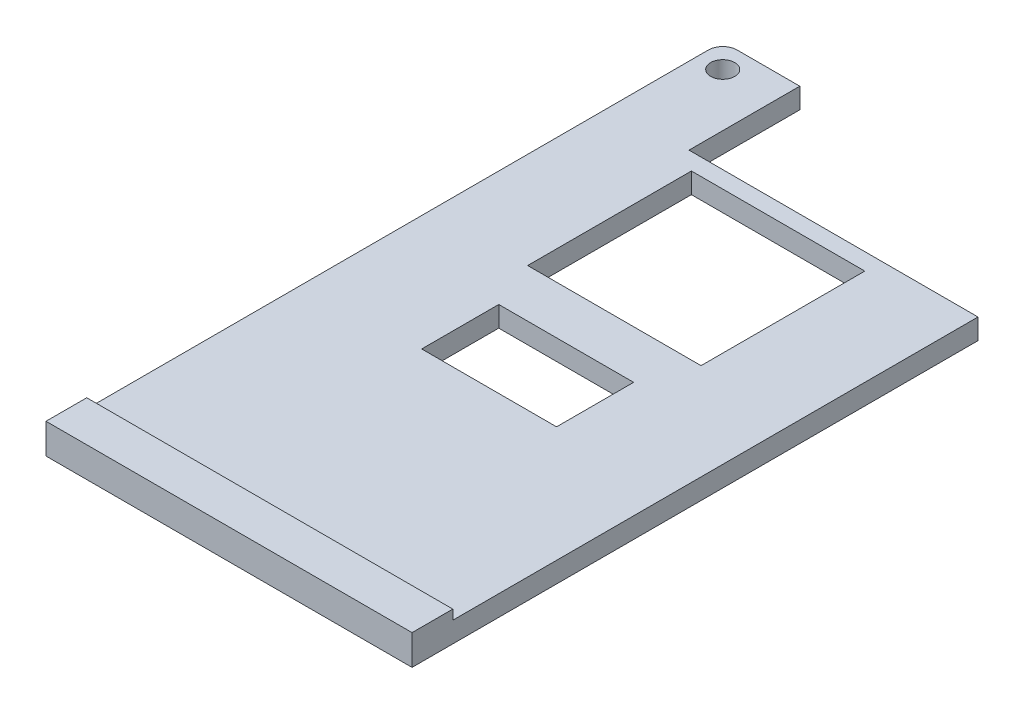
ISO-10303-21;
HEADER;
FILE_DESCRIPTION(('STEP AP214'),'2;1');
FILE_NAME('part.step','',(''),(''),'','','');
FILE_SCHEMA(('AUTOMOTIVE_DESIGN { 1 0 10303 214 1 1 1 1 }'));
ENDSEC;
DATA;
#1=APPLICATION_CONTEXT('core data for automotive mechanical design processes');
#2=APPLICATION_PROTOCOL_DEFINITION('international standard','automotive_design',2000,#1);
#3=PRODUCT_CONTEXT('',#1,'mechanical');
#4=PRODUCT('Part','Part','',(#3));
#5=PRODUCT_RELATED_PRODUCT_CATEGORY('part','',(#4));
#6=PRODUCT_DEFINITION_FORMATION('','',#4);
#7=PRODUCT_DEFINITION_CONTEXT('part definition',#1,'design');
#8=PRODUCT_DEFINITION('design','',#6,#7);
#9=PRODUCT_DEFINITION_SHAPE('','',#8);
#10=(LENGTH_UNIT() NAMED_UNIT(*) SI_UNIT(.MILLI.,.METRE.));
#11=(NAMED_UNIT(*) PLANE_ANGLE_UNIT() SI_UNIT($,.RADIAN.));
#12=(NAMED_UNIT(*) SI_UNIT($,.STERADIAN.) SOLID_ANGLE_UNIT());
#13=UNCERTAINTY_MEASURE_WITH_UNIT(LENGTH_MEASURE(1.E-05),#10,'distance_accuracy_value','');
#14=(GEOMETRIC_REPRESENTATION_CONTEXT(3) GLOBAL_UNCERTAINTY_ASSIGNED_CONTEXT((#13)) GLOBAL_UNIT_ASSIGNED_CONTEXT((#10,
#11,#12)) REPRESENTATION_CONTEXT('',''));
#15=CARTESIAN_POINT('',(0.,0.,0.));
#16=DIRECTION('',(0.,0.,1.));
#17=DIRECTION('',(1.,0.,0.));
#18=AXIS2_PLACEMENT_3D('',#15,#16,#17);
#19=CARTESIAN_POINT('',(36.5,2.13,-88.));
#20=DIRECTION('',(0.,-1.,0.));
#21=DIRECTION('',(0.,0.,-1.));
#22=AXIS2_PLACEMENT_3D('',#19,#20,#21);
#23=PLANE('',#22);
#24=CARTESIAN_POINT('',(2.5,2.13,-87.));
#25=DIRECTION('',(0.,1.,0.));
#26=DIRECTION('',(0.,0.,1.));
#27=AXIS2_PLACEMENT_3D('',#24,#25,#26);
#28=CIRCLE('',#27,1.25);
#29=CARTESIAN_POINT('',(2.5,2.13,-85.75));
#30=VERTEX_POINT('',#29);
#31=EDGE_CURVE('E239',#30,#30,#28,.T.);
#32=ORIENTED_EDGE('',*,*,#31,.F.);
#33=EDGE_LOOP('',(#32));
#34=FACE_BOUND('',#33,.T.);
#35=DIRECTION('',(0.,0.,1.));
#36=VECTOR('',#35,1.);
#37=CARTESIAN_POINT('',(12.,2.13,-46.25));
#38=LINE('',#37,#36);
#39=CARTESIAN_POINT('',(12.,2.13,-54.25));
#40=VERTEX_POINT('',#39);
#41=CARTESIAN_POINT('',(12.,2.13,-46.25));
#42=VERTEX_POINT('',#41);
#43=EDGE_CURVE('E245',#40,#42,#38,.T.);
#44=ORIENTED_EDGE('',*,*,#43,.F.);
#45=DIRECTION('',(-1.,0.,0.));
#46=VECTOR('',#45,1.);
#47=CARTESIAN_POINT('',(12.,2.13,-54.25));
#48=LINE('',#47,#46);
#49=CARTESIAN_POINT('',(26.,2.13,-54.25));
#50=VERTEX_POINT('',#49);
#51=EDGE_CURVE('E253',#50,#40,#48,.T.);
#52=ORIENTED_EDGE('',*,*,#51,.F.);
#53=DIRECTION('',(0.,0.,-1.));
#54=VECTOR('',#53,1.);
#55=CARTESIAN_POINT('',(26.,2.13,-54.25));
#56=LINE('',#55,#54);
#57=CARTESIAN_POINT('',(26.,2.13,-46.25));
#58=VERTEX_POINT('',#57);
#59=EDGE_CURVE('E250',#58,#50,#56,.T.);
#60=ORIENTED_EDGE('',*,*,#59,.F.);
#61=DIRECTION('',(1.,0.,0.));
#62=VECTOR('',#61,1.);
#63=CARTESIAN_POINT('',(26.,2.13,-46.25));
#64=LINE('',#63,#62);
#65=EDGE_CURVE('E247',#42,#58,#64,.T.);
#66=ORIENTED_EDGE('',*,*,#65,.F.);
#67=EDGE_LOOP('',(#44,#52,#60,#66));
#68=FACE_BOUND('',#67,.T.);
#69=DIRECTION('',(0.,0.,1.));
#70=VECTOR('',#69,1.);
#71=CARTESIAN_POINT('',(10.,2.13,-76.25));
#72=LINE('',#71,#70);
#73=CARTESIAN_POINT('',(10.,2.13,-76.25));
#74=VERTEX_POINT('',#73);
#75=CARTESIAN_POINT('',(10.,2.13,-59.25));
#76=VERTEX_POINT('',#75);
#77=EDGE_CURVE('E276',#74,#76,#72,.T.);
#78=ORIENTED_EDGE('',*,*,#77,.F.);
#79=DIRECTION('',(-1.,0.,0.));
#80=VECTOR('',#79,1.);
#81=CARTESIAN_POINT('',(10.,2.13,-76.25));
#82=LINE('',#81,#80);
#83=CARTESIAN_POINT('',(28.,2.13,-76.25));
#84=VERTEX_POINT('',#83);
#85=EDGE_CURVE('E284',#84,#74,#82,.T.);
#86=ORIENTED_EDGE('',*,*,#85,.F.);
#87=DIRECTION('',(0.,0.,-1.));
#88=VECTOR('',#87,1.);
#89=CARTESIAN_POINT('',(28.,2.13,-76.25));
#90=LINE('',#89,#88);
#91=CARTESIAN_POINT('',(28.,2.13,-59.25));
#92=VERTEX_POINT('',#91);
#93=EDGE_CURVE('E281',#92,#84,#90,.T.);
#94=ORIENTED_EDGE('',*,*,#93,.F.);
#95=DIRECTION('',(1.,0.,0.));
#96=VECTOR('',#95,1.);
#97=CARTESIAN_POINT('',(28.,2.13,-59.25));
#98=LINE('',#97,#96);
#99=EDGE_CURVE('E278',#76,#92,#98,.T.);
#100=ORIENTED_EDGE('',*,*,#99,.F.);
#101=EDGE_LOOP('',(#78,#86,#94,#100));
#102=FACE_BOUND('',#101,.T.);
#103=DIRECTION('',(0.,0.,-1.));
#104=VECTOR('',#103,1.);
#105=CARTESIAN_POINT('',(38.,2.13,-19.25));
#106=LINE('',#105,#104);
#107=CARTESIAN_POINT('',(38.,2.13,-23.48));
#108=VERTEX_POINT('',#107);
#109=CARTESIAN_POINT('',(38.,2.13,-78.));
#110=VERTEX_POINT('',#109);
#111=EDGE_CURVE('E184',#108,#110,#106,.T.);
#112=ORIENTED_EDGE('',*,*,#111,.T.);
#113=DIRECTION('',(-1.,0.,0.));
#114=VECTOR('',#113,1.);
#115=CARTESIAN_POINT('',(8.,2.13,-78.));
#116=LINE('',#115,#114);
#117=CARTESIAN_POINT('',(8.,2.13,-78.));
#118=VERTEX_POINT('',#117);
#119=EDGE_CURVE('E51',#110,#118,#116,.T.);
#120=ORIENTED_EDGE('',*,*,#119,.T.);
#121=DIRECTION('',(0.,0.,-1.));
#122=VECTOR('',#121,1.);
#123=CARTESIAN_POINT('',(8.,2.13,-89.5));
#124=LINE('',#123,#122);
#125=CARTESIAN_POINT('',(8.,2.13,-89.5));
#126=VERTEX_POINT('',#125);
#127=EDGE_CURVE('E176',#118,#126,#124,.T.);
#128=ORIENTED_EDGE('',*,*,#127,.T.);
#129=DIRECTION('',(-1.,0.,0.));
#130=VECTOR('',#129,1.);
#131=CARTESIAN_POINT('',(1.50000000000001,2.13,-89.5));
#132=LINE('',#131,#130);
#133=CARTESIAN_POINT('',(1.50000000000001,2.13,-89.5));
#134=VERTEX_POINT('',#133);
#135=EDGE_CURVE('E199',#126,#134,#132,.T.);
#136=ORIENTED_EDGE('',*,*,#135,.T.);
#137=CARTESIAN_POINT('',(1.5,2.13,-88.));
#138=DIRECTION('',(0.,1.,0.));
#139=DIRECTION('',(0.,0.,-1.));
#140=AXIS2_PLACEMENT_3D('',#137,#138,#139);
#141=CIRCLE('',#140,1.5);
#142=CARTESIAN_POINT('',(0.,2.13,-88.));
#143=VERTEX_POINT('',#142);
#144=EDGE_CURVE('E307',#134,#143,#141,.T.);
#145=ORIENTED_EDGE('',*,*,#144,.T.);
#146=DIRECTION('',(0.,0.,1.));
#147=VECTOR('',#146,1.);
#148=CARTESIAN_POINT('',(0.,2.13,-19.25));
#149=LINE('',#148,#147);
#150=CARTESIAN_POINT('',(0.,2.13,-23.48));
#151=VERTEX_POINT('',#150);
#152=EDGE_CURVE('E309',#143,#151,#149,.T.);
#153=ORIENTED_EDGE('',*,*,#152,.T.);
#154=DIRECTION('',(-1.,0.,0.));
#155=VECTOR('',#154,1.);
#156=CARTESIAN_POINT('',(0.,2.13,-23.48));
#157=LINE('',#156,#155);
#158=EDGE_CURVE('E59',#108,#151,#157,.T.);
#159=ORIENTED_EDGE('',*,*,#158,.F.);
#160=EDGE_LOOP('',(#112,#120,#128,#136,#145,#153,#159));
#161=FACE_BOUND('',#160,.T.);
#162=ADVANCED_FACE('F36',(#34,#68,#102,#161),#23,.F.);
#163=CARTESIAN_POINT('',(36.5,0.,-88.));
#164=DIRECTION('',(0.,-1.,0.));
#165=DIRECTION('',(0.,0.,-1.));
#166=AXIS2_PLACEMENT_3D('',#163,#164,#165);
#167=PLANE('',#166);
#168=DIRECTION('',(-1.,0.,0.));
#169=VECTOR('',#168,1.);
#170=CARTESIAN_POINT('',(8.,0.,-78.));
#171=LINE('',#170,#169);
#172=CARTESIAN_POINT('',(38.,0.,-78.));
#173=VERTEX_POINT('',#172);
#174=CARTESIAN_POINT('',(8.,0.,-78.));
#175=VERTEX_POINT('',#174);
#176=EDGE_CURVE('E157',#173,#175,#171,.T.);
#177=ORIENTED_EDGE('',*,*,#176,.F.);
#178=DIRECTION('',(0.,0.,-1.));
#179=VECTOR('',#178,1.);
#180=CARTESIAN_POINT('',(38.,0.,-19.25));
#181=LINE('',#180,#179);
#182=CARTESIAN_POINT('',(38.,0.,-19.25));
#183=VERTEX_POINT('',#182);
#184=EDGE_CURVE('E162',#183,#173,#181,.T.);
#185=ORIENTED_EDGE('',*,*,#184,.F.);
#186=DIRECTION('',(1.,0.,0.));
#187=VECTOR('',#186,1.);
#188=CARTESIAN_POINT('',(0.,0.,-19.25));
#189=LINE('',#188,#187);
#190=CARTESIAN_POINT('',(0.,0.,-19.25));
#191=VERTEX_POINT('',#190);
#192=EDGE_CURVE('E174',#191,#183,#189,.T.);
#193=ORIENTED_EDGE('',*,*,#192,.F.);
#194=DIRECTION('',(0.,0.,1.));
#195=VECTOR('',#194,1.);
#196=CARTESIAN_POINT('',(0.,0.,-19.25));
#197=LINE('',#196,#195);
#198=CARTESIAN_POINT('',(0.,0.,-88.));
#199=VERTEX_POINT('',#198);
#200=EDGE_CURVE('E178',#199,#191,#197,.T.);
#201=ORIENTED_EDGE('',*,*,#200,.F.);
#202=CARTESIAN_POINT('',(1.5,0.,-88.));
#203=DIRECTION('',(0.,1.,0.));
#204=DIRECTION('',(0.,0.,-1.));
#205=AXIS2_PLACEMENT_3D('',#202,#203,#204);
#206=CIRCLE('',#205,1.5);
#207=CARTESIAN_POINT('',(1.50000000000001,0.,-89.5));
#208=VERTEX_POINT('',#207);
#209=EDGE_CURVE('E204',#208,#199,#206,.T.);
#210=ORIENTED_EDGE('',*,*,#209,.F.);
#211=DIRECTION('',(-1.,0.,0.));
#212=VECTOR('',#211,1.);
#213=CARTESIAN_POINT('',(1.50000000000001,0.,-89.5));
#214=LINE('',#213,#212);
#215=CARTESIAN_POINT('',(8.,0.,-89.5));
#216=VERTEX_POINT('',#215);
#217=EDGE_CURVE('E198',#216,#208,#214,.T.);
#218=ORIENTED_EDGE('',*,*,#217,.F.);
#219=DIRECTION('',(0.,0.,-1.));
#220=VECTOR('',#219,1.);
#221=CARTESIAN_POINT('',(8.,0.,-89.5));
#222=LINE('',#221,#220);
#223=EDGE_CURVE('E164',#175,#216,#222,.T.);
#224=ORIENTED_EDGE('',*,*,#223,.F.);
#225=EDGE_LOOP('',(#177,#185,#193,#201,#210,#218,#224));
#226=FACE_BOUND('',#225,.T.);
#227=CARTESIAN_POINT('',(2.5,0.,-87.));
#228=DIRECTION('',(0.,1.,0.));
#229=DIRECTION('',(0.,0.,1.));
#230=AXIS2_PLACEMENT_3D('',#227,#228,#229);
#231=CIRCLE('',#230,1.25);
#232=CARTESIAN_POINT('',(2.5,0.,-85.75));
#233=VERTEX_POINT('',#232);
#234=EDGE_CURVE('E238',#233,#233,#231,.T.);
#235=ORIENTED_EDGE('',*,*,#234,.T.);
#236=EDGE_LOOP('',(#235));
#237=FACE_BOUND('',#236,.T.);
#238=DIRECTION('',(-1.,0.,0.));
#239=VECTOR('',#238,1.);
#240=CARTESIAN_POINT('',(10.,0.,-76.25));
#241=LINE('',#240,#239);
#242=CARTESIAN_POINT('',(28.,0.,-76.25));
#243=VERTEX_POINT('',#242);
#244=CARTESIAN_POINT('',(10.,0.,-76.25));
#245=VERTEX_POINT('',#244);
#246=EDGE_CURVE('E279',#243,#245,#241,.T.);
#247=ORIENTED_EDGE('',*,*,#246,.T.);
#248=DIRECTION('',(0.,0.,1.));
#249=VECTOR('',#248,1.);
#250=CARTESIAN_POINT('',(10.,0.,-76.25));
#251=LINE('',#250,#249);
#252=CARTESIAN_POINT('',(10.,0.,-59.25));
#253=VERTEX_POINT('',#252);
#254=EDGE_CURVE('E275',#245,#253,#251,.T.);
#255=ORIENTED_EDGE('',*,*,#254,.T.);
#256=DIRECTION('',(1.,0.,0.));
#257=VECTOR('',#256,1.);
#258=CARTESIAN_POINT('',(28.,0.,-59.25));
#259=LINE('',#258,#257);
#260=CARTESIAN_POINT('',(28.,0.,-59.25));
#261=VERTEX_POINT('',#260);
#262=EDGE_CURVE('E289',#253,#261,#259,.T.);
#263=ORIENTED_EDGE('',*,*,#262,.T.);
#264=DIRECTION('',(0.,0.,-1.));
#265=VECTOR('',#264,1.);
#266=CARTESIAN_POINT('',(28.,0.,-76.25));
#267=LINE('',#266,#265);
#268=EDGE_CURVE('E292',#261,#243,#267,.T.);
#269=ORIENTED_EDGE('',*,*,#268,.T.);
#270=EDGE_LOOP('',(#247,#255,#263,#269));
#271=FACE_BOUND('',#270,.T.);
#272=DIRECTION('',(-1.,0.,0.));
#273=VECTOR('',#272,1.);
#274=CARTESIAN_POINT('',(12.,0.,-54.25));
#275=LINE('',#274,#273);
#276=CARTESIAN_POINT('',(26.,0.,-54.25));
#277=VERTEX_POINT('',#276);
#278=CARTESIAN_POINT('',(12.,0.,-54.25));
#279=VERTEX_POINT('',#278);
#280=EDGE_CURVE('E248',#277,#279,#275,.T.);
#281=ORIENTED_EDGE('',*,*,#280,.T.);
#282=DIRECTION('',(0.,0.,1.));
#283=VECTOR('',#282,1.);
#284=CARTESIAN_POINT('',(12.,0.,-46.25));
#285=LINE('',#284,#283);
#286=CARTESIAN_POINT('',(12.,0.,-46.25));
#287=VERTEX_POINT('',#286);
#288=EDGE_CURVE('E242',#279,#287,#285,.T.);
#289=ORIENTED_EDGE('',*,*,#288,.T.);
#290=DIRECTION('',(1.,0.,0.));
#291=VECTOR('',#290,1.);
#292=CARTESIAN_POINT('',(26.,0.,-46.25));
#293=LINE('',#292,#291);
#294=CARTESIAN_POINT('',(26.,0.,-46.25));
#295=VERTEX_POINT('',#294);
#296=EDGE_CURVE('E258',#287,#295,#293,.T.);
#297=ORIENTED_EDGE('',*,*,#296,.T.);
#298=DIRECTION('',(0.,0.,-1.));
#299=VECTOR('',#298,1.);
#300=CARTESIAN_POINT('',(26.,0.,-54.25));
#301=LINE('',#300,#299);
#302=EDGE_CURVE('E261',#295,#277,#301,.T.);
#303=ORIENTED_EDGE('',*,*,#302,.T.);
#304=EDGE_LOOP('',(#281,#289,#297,#303));
#305=FACE_BOUND('',#304,.T.);
#306=ADVANCED_FACE('F158',(#226,#237,#271,#305),#167,.T.);
#307=CARTESIAN_POINT('',(8.,2.13,-78.));
#308=DIRECTION('',(0.,0.,1.));
#309=DIRECTION('',(1.,0.,0.));
#310=AXIS2_PLACEMENT_3D('',#307,#308,#309);
#311=PLANE('',#310);
#312=ORIENTED_EDGE('',*,*,#176,.T.);
#313=DIRECTION('',(0.,-1.,0.));
#314=VECTOR('',#313,1.);
#315=CARTESIAN_POINT('',(8.,2.13,-78.));
#316=LINE('',#315,#314);
#317=EDGE_CURVE('E11',#118,#175,#316,.T.);
#318=ORIENTED_EDGE('',*,*,#317,.F.);
#319=ORIENTED_EDGE('',*,*,#119,.F.);
#320=DIRECTION('',(0.,-1.,0.));
#321=VECTOR('',#320,1.);
#322=CARTESIAN_POINT('',(38.,2.13,-78.));
#323=LINE('',#322,#321);
#324=EDGE_CURVE('E167',#110,#173,#323,.T.);
#325=ORIENTED_EDGE('',*,*,#324,.T.);
#326=EDGE_LOOP('',(#312,#318,#319,#325));
#327=FACE_BOUND('',#326,.T.);
#328=ADVANCED_FACE('F38',(#327),#311,.F.);
#329=CARTESIAN_POINT('',(8.,2.13,-89.5));
#330=DIRECTION('',(-1.,0.,0.));
#331=DIRECTION('',(0.,0.,1.));
#332=AXIS2_PLACEMENT_3D('',#329,#330,#331);
#333=PLANE('',#332);
#334=ORIENTED_EDGE('',*,*,#223,.T.);
#335=DIRECTION('',(0.,-1.,0.));
#336=VECTOR('',#335,1.);
#337=CARTESIAN_POINT('',(8.,2.13,-89.5));
#338=LINE('',#337,#336);
#339=EDGE_CURVE('E44',#126,#216,#338,.T.);
#340=ORIENTED_EDGE('',*,*,#339,.F.);
#341=ORIENTED_EDGE('',*,*,#127,.F.);
#342=ORIENTED_EDGE('',*,*,#317,.T.);
#343=EDGE_LOOP('',(#334,#340,#341,#342));
#344=FACE_BOUND('',#343,.T.);
#345=ADVANCED_FACE('F324',(#344),#333,.F.);
#346=CARTESIAN_POINT('',(1.50000000000001,2.13,-89.5));
#347=DIRECTION('',(0.,0.,1.));
#348=DIRECTION('',(1.,0.,0.));
#349=AXIS2_PLACEMENT_3D('',#346,#347,#348);
#350=PLANE('',#349);
#351=ORIENTED_EDGE('',*,*,#217,.T.);
#352=DIRECTION('',(0.,-1.,0.));
#353=VECTOR('',#352,1.);
#354=CARTESIAN_POINT('',(1.50000000000001,2.13,-89.5));
#355=LINE('',#354,#353);
#356=EDGE_CURVE('E190',#134,#208,#355,.T.);
#357=ORIENTED_EDGE('',*,*,#356,.F.);
#358=ORIENTED_EDGE('',*,*,#135,.F.);
#359=ORIENTED_EDGE('',*,*,#339,.T.);
#360=EDGE_LOOP('',(#351,#357,#358,#359));
#361=FACE_BOUND('',#360,.T.);
#362=ADVANCED_FACE('F196',(#361),#350,.F.);
#363=CARTESIAN_POINT('',(1.5,2.13,-88.));
#364=DIRECTION('',(0.,-1.,0.));
#365=DIRECTION('',(0.,0.,-1.));
#366=AXIS2_PLACEMENT_3D('',#363,#364,#365);
#367=CYLINDRICAL_SURFACE('',#366,1.5);
#368=ORIENTED_EDGE('',*,*,#209,.T.);
#369=DIRECTION('',(0.,-1.,0.));
#370=VECTOR('',#369,1.);
#371=CARTESIAN_POINT('',(0.,2.13,-88.));
#372=LINE('',#371,#370);
#373=EDGE_CURVE('E187',#143,#199,#372,.T.);
#374=ORIENTED_EDGE('',*,*,#373,.F.);
#375=ORIENTED_EDGE('',*,*,#144,.F.);
#376=ORIENTED_EDGE('',*,*,#356,.T.);
#377=EDGE_LOOP('',(#368,#374,#375,#376));
#378=FACE_BOUND('',#377,.T.);
#379=ADVANCED_FACE('F316',(#378),#367,.T.);
#380=CARTESIAN_POINT('',(0.,2.13,-19.25));
#381=DIRECTION('',(1.,0.,0.));
#382=DIRECTION('',(0.,0.,-1.));
#383=AXIS2_PLACEMENT_3D('',#380,#381,#382);
#384=PLANE('',#383);
#385=ORIENTED_EDGE('',*,*,#200,.T.);
#386=DIRECTION('',(0.,-1.,0.));
#387=VECTOR('',#386,1.);
#388=CARTESIAN_POINT('',(0.,2.13,-19.25));
#389=LINE('',#388,#387);
#390=CARTESIAN_POINT('',(0.,3.13,-19.25));
#391=VERTEX_POINT('',#390);
#392=EDGE_CURVE('E183',#391,#191,#389,.T.);
#393=ORIENTED_EDGE('',*,*,#392,.F.);
#394=DIRECTION('',(0.,0.,1.));
#395=VECTOR('',#394,1.);
#396=CARTESIAN_POINT('',(0.,3.13,-19.25));
#397=LINE('',#396,#395);
#398=CARTESIAN_POINT('',(0.,3.13,-23.48));
#399=VERTEX_POINT('',#398);
#400=EDGE_CURVE('E221',#399,#391,#397,.T.);
#401=ORIENTED_EDGE('',*,*,#400,.F.);
#402=DIRECTION('',(0.,-1.,0.));
#403=VECTOR('',#402,1.);
#404=CARTESIAN_POINT('',(0.,3.13,-23.48));
#405=LINE('',#404,#403);
#406=EDGE_CURVE('E232',#399,#151,#405,.T.);
#407=ORIENTED_EDGE('',*,*,#406,.T.);
#408=ORIENTED_EDGE('',*,*,#152,.F.);
#409=ORIENTED_EDGE('',*,*,#373,.T.);
#410=EDGE_LOOP('',(#385,#393,#401,#407,#408,#409));
#411=FACE_BOUND('',#410,.T.);
#412=ADVANCED_FACE('F209',(#411),#384,.F.);
#413=CARTESIAN_POINT('',(0.,2.13,-19.25));
#414=DIRECTION('',(0.,0.,-1.));
#415=DIRECTION('',(-1.,0.,0.));
#416=AXIS2_PLACEMENT_3D('',#413,#414,#415);
#417=PLANE('',#416);
#418=ORIENTED_EDGE('',*,*,#192,.T.);
#419=DIRECTION('',(0.,-1.,0.));
#420=VECTOR('',#419,1.);
#421=CARTESIAN_POINT('',(38.,2.13,-19.25));
#422=LINE('',#421,#420);
#423=CARTESIAN_POINT('',(38.,3.13,-19.25));
#424=VERTEX_POINT('',#423);
#425=EDGE_CURVE('E173',#424,#183,#422,.T.);
#426=ORIENTED_EDGE('',*,*,#425,.F.);
#427=DIRECTION('',(1.,0.,0.));
#428=VECTOR('',#427,1.);
#429=CARTESIAN_POINT('',(0.,3.13,-19.25));
#430=LINE('',#429,#428);
#431=EDGE_CURVE('E217',#391,#424,#430,.T.);
#432=ORIENTED_EDGE('',*,*,#431,.F.);
#433=ORIENTED_EDGE('',*,*,#392,.T.);
#434=EDGE_LOOP('',(#418,#426,#432,#433));
#435=FACE_BOUND('',#434,.T.);
#436=ADVANCED_FACE('F215',(#435),#417,.F.);
#437=CARTESIAN_POINT('',(38.,2.13,-19.25));
#438=DIRECTION('',(-1.,0.,0.));
#439=DIRECTION('',(0.,0.,1.));
#440=AXIS2_PLACEMENT_3D('',#437,#438,#439);
#441=PLANE('',#440);
#442=ORIENTED_EDGE('',*,*,#184,.T.);
#443=ORIENTED_EDGE('',*,*,#324,.F.);
#444=ORIENTED_EDGE('',*,*,#111,.F.);
#445=DIRECTION('',(0.,-1.,0.));
#446=VECTOR('',#445,1.);
#447=CARTESIAN_POINT('',(38.,3.13,-23.48));
#448=LINE('',#447,#446);
#449=CARTESIAN_POINT('',(38.,3.13,-23.48));
#450=VERTEX_POINT('',#449);
#451=EDGE_CURVE('E235',#450,#108,#448,.T.);
#452=ORIENTED_EDGE('',*,*,#451,.F.);
#453=DIRECTION('',(0.,0.,-1.));
#454=VECTOR('',#453,1.);
#455=CARTESIAN_POINT('',(38.,3.13,-19.25));
#456=LINE('',#455,#454);
#457=EDGE_CURVE('E220',#424,#450,#456,.T.);
#458=ORIENTED_EDGE('',*,*,#457,.F.);
#459=ORIENTED_EDGE('',*,*,#425,.T.);
#460=EDGE_LOOP('',(#442,#443,#444,#452,#458,#459));
#461=FACE_BOUND('',#460,.T.);
#462=ADVANCED_FACE('F171',(#461),#441,.F.);
#463=CARTESIAN_POINT('',(10.,2.13,-76.25));
#464=DIRECTION('',(1.,0.,0.));
#465=DIRECTION('',(0.,0.,-1.));
#466=AXIS2_PLACEMENT_3D('',#463,#464,#465);
#467=PLANE('',#466);
#468=ORIENTED_EDGE('',*,*,#254,.F.);
#469=DIRECTION('',(0.,-1.,0.));
#470=VECTOR('',#469,1.);
#471=CARTESIAN_POINT('',(10.,2.13,-76.25));
#472=LINE('',#471,#470);
#473=EDGE_CURVE('E286',#74,#245,#472,.T.);
#474=ORIENTED_EDGE('',*,*,#473,.F.);
#475=ORIENTED_EDGE('',*,*,#77,.T.);
#476=DIRECTION('',(0.,-1.,0.));
#477=VECTOR('',#476,1.);
#478=CARTESIAN_POINT('',(10.,2.13,-59.25));
#479=LINE('',#478,#477);
#480=EDGE_CURVE('E165',#76,#253,#479,.T.);
#481=ORIENTED_EDGE('',*,*,#480,.T.);
#482=EDGE_LOOP('',(#468,#474,#475,#481));
#483=FACE_BOUND('',#482,.T.);
#484=ADVANCED_FACE('F336',(#483),#467,.T.);
#485=CARTESIAN_POINT('',(28.,2.13,-59.25));
#486=DIRECTION('',(0.,0.,-1.));
#487=DIRECTION('',(-1.,0.,0.));
#488=AXIS2_PLACEMENT_3D('',#485,#486,#487);
#489=PLANE('',#488);
#490=ORIENTED_EDGE('',*,*,#262,.F.);
#491=ORIENTED_EDGE('',*,*,#480,.F.);
#492=ORIENTED_EDGE('',*,*,#99,.T.);
#493=DIRECTION('',(0.,-1.,0.));
#494=VECTOR('',#493,1.);
#495=CARTESIAN_POINT('',(28.,2.13,-59.25));
#496=LINE('',#495,#494);
#497=EDGE_CURVE('E301',#92,#261,#496,.T.);
#498=ORIENTED_EDGE('',*,*,#497,.T.);
#499=EDGE_LOOP('',(#490,#491,#492,#498));
#500=FACE_BOUND('',#499,.T.);
#501=ADVANCED_FACE('F359',(#500),#489,.T.);
#502=CARTESIAN_POINT('',(28.,2.13,-76.25));
#503=DIRECTION('',(-1.,0.,0.));
#504=DIRECTION('',(0.,0.,1.));
#505=AXIS2_PLACEMENT_3D('',#502,#503,#504);
#506=PLANE('',#505);
#507=ORIENTED_EDGE('',*,*,#268,.F.);
#508=ORIENTED_EDGE('',*,*,#497,.F.);
#509=ORIENTED_EDGE('',*,*,#93,.T.);
#510=DIRECTION('',(0.,-1.,0.));
#511=VECTOR('',#510,1.);
#512=CARTESIAN_POINT('',(28.,2.13,-76.25));
#513=LINE('',#512,#511);
#514=EDGE_CURVE('E299',#84,#243,#513,.T.);
#515=ORIENTED_EDGE('',*,*,#514,.T.);
#516=EDGE_LOOP('',(#507,#508,#509,#515));
#517=FACE_BOUND('',#516,.T.);
#518=ADVANCED_FACE('F366',(#517),#506,.T.);
#519=CARTESIAN_POINT('',(10.,2.13,-76.25));
#520=DIRECTION('',(0.,0.,1.));
#521=DIRECTION('',(1.,0.,0.));
#522=AXIS2_PLACEMENT_3D('',#519,#520,#521);
#523=PLANE('',#522);
#524=ORIENTED_EDGE('',*,*,#246,.F.);
#525=ORIENTED_EDGE('',*,*,#514,.F.);
#526=ORIENTED_EDGE('',*,*,#85,.T.);
#527=ORIENTED_EDGE('',*,*,#473,.T.);
#528=EDGE_LOOP('',(#524,#525,#526,#527));
#529=FACE_BOUND('',#528,.T.);
#530=ADVANCED_FACE('F373',(#529),#523,.T.);
#531=CARTESIAN_POINT('',(12.,2.13,-46.25));
#532=DIRECTION('',(1.,0.,0.));
#533=DIRECTION('',(0.,0.,-1.));
#534=AXIS2_PLACEMENT_3D('',#531,#532,#533);
#535=PLANE('',#534);
#536=ORIENTED_EDGE('',*,*,#288,.F.);
#537=DIRECTION('',(0.,-1.,0.));
#538=VECTOR('',#537,1.);
#539=CARTESIAN_POINT('',(12.,2.13,-54.25));
#540=LINE('',#539,#538);
#541=EDGE_CURVE('E255',#40,#279,#540,.T.);
#542=ORIENTED_EDGE('',*,*,#541,.F.);
#543=ORIENTED_EDGE('',*,*,#43,.T.);
#544=DIRECTION('',(0.,-1.,0.));
#545=VECTOR('',#544,1.);
#546=CARTESIAN_POINT('',(12.,2.13,-46.25));
#547=LINE('',#546,#545);
#548=EDGE_CURVE('E272',#42,#287,#547,.T.);
#549=ORIENTED_EDGE('',*,*,#548,.T.);
#550=EDGE_LOOP('',(#536,#542,#543,#549));
#551=FACE_BOUND('',#550,.T.);
#552=ADVANCED_FACE('F381',(#551),#535,.T.);
#553=CARTESIAN_POINT('',(26.,2.13,-46.25));
#554=DIRECTION('',(0.,0.,-1.));
#555=DIRECTION('',(-1.,0.,0.));
#556=AXIS2_PLACEMENT_3D('',#553,#554,#555);
#557=PLANE('',#556);
#558=ORIENTED_EDGE('',*,*,#296,.F.);
#559=ORIENTED_EDGE('',*,*,#548,.F.);
#560=ORIENTED_EDGE('',*,*,#65,.T.);
#561=DIRECTION('',(0.,-1.,0.));
#562=VECTOR('',#561,1.);
#563=CARTESIAN_POINT('',(26.,2.13,-46.25));
#564=LINE('',#563,#562);
#565=EDGE_CURVE('E270',#58,#295,#564,.T.);
#566=ORIENTED_EDGE('',*,*,#565,.T.);
#567=EDGE_LOOP('',(#558,#559,#560,#566));
#568=FACE_BOUND('',#567,.T.);
#569=ADVANCED_FACE('F389',(#568),#557,.T.);
#570=CARTESIAN_POINT('',(26.,2.13,-54.25));
#571=DIRECTION('',(-1.,0.,0.));
#572=DIRECTION('',(0.,0.,1.));
#573=AXIS2_PLACEMENT_3D('',#570,#571,#572);
#574=PLANE('',#573);
#575=ORIENTED_EDGE('',*,*,#302,.F.);
#576=ORIENTED_EDGE('',*,*,#565,.F.);
#577=ORIENTED_EDGE('',*,*,#59,.T.);
#578=DIRECTION('',(0.,-1.,0.));
#579=VECTOR('',#578,1.);
#580=CARTESIAN_POINT('',(26.,2.13,-54.25));
#581=LINE('',#580,#579);
#582=EDGE_CURVE('E268',#50,#277,#581,.T.);
#583=ORIENTED_EDGE('',*,*,#582,.T.);
#584=EDGE_LOOP('',(#575,#576,#577,#583));
#585=FACE_BOUND('',#584,.T.);
#586=ADVANCED_FACE('F397',(#585),#574,.T.);
#587=CARTESIAN_POINT('',(12.,2.13,-54.25));
#588=DIRECTION('',(0.,0.,1.));
#589=DIRECTION('',(1.,0.,0.));
#590=AXIS2_PLACEMENT_3D('',#587,#588,#589);
#591=PLANE('',#590);
#592=ORIENTED_EDGE('',*,*,#280,.F.);
#593=ORIENTED_EDGE('',*,*,#582,.F.);
#594=ORIENTED_EDGE('',*,*,#51,.T.);
#595=ORIENTED_EDGE('',*,*,#541,.T.);
#596=EDGE_LOOP('',(#592,#593,#594,#595));
#597=FACE_BOUND('',#596,.T.);
#598=ADVANCED_FACE('F405',(#597),#591,.T.);
#599=CARTESIAN_POINT('',(2.5,2.13,-87.));
#600=DIRECTION('',(0.,-1.,0.));
#601=DIRECTION('',(0.,0.,-1.));
#602=AXIS2_PLACEMENT_3D('',#599,#600,#601);
#603=CYLINDRICAL_SURFACE('',#602,1.25);
#604=ORIENTED_EDGE('',*,*,#31,.T.);
#605=EDGE_LOOP('',(#604));
#606=FACE_BOUND('',#605,.T.);
#607=ORIENTED_EDGE('',*,*,#234,.F.);
#608=EDGE_LOOP('',(#607));
#609=FACE_BOUND('',#608,.T.);
#610=ADVANCED_FACE('F413',(#606,#609),#603,.F.);
#611=CARTESIAN_POINT('',(0.,3.13,-23.48));
#612=DIRECTION('',(0.,0.,1.));
#613=DIRECTION('',(1.,0.,0.));
#614=AXIS2_PLACEMENT_3D('',#611,#612,#613);
#615=PLANE('',#614);
#616=ORIENTED_EDGE('',*,*,#158,.T.);
#617=ORIENTED_EDGE('',*,*,#406,.F.);
#618=DIRECTION('',(-1.,0.,0.));
#619=VECTOR('',#618,1.);
#620=CARTESIAN_POINT('',(0.,3.13,-23.48));
#621=LINE('',#620,#619);
#622=EDGE_CURVE('E225',#450,#399,#621,.T.);
#623=ORIENTED_EDGE('',*,*,#622,.F.);
#624=ORIENTED_EDGE('',*,*,#451,.T.);
#625=EDGE_LOOP('',(#616,#617,#623,#624));
#626=FACE_BOUND('',#625,.T.);
#627=ADVANCED_FACE('F313',(#626),#615,.F.);
#628=CARTESIAN_POINT('',(0.,3.13,0.));
#629=DIRECTION('',(0.,-1.,0.));
#630=DIRECTION('',(0.,0.,-1.));
#631=AXIS2_PLACEMENT_3D('',#628,#629,#630);
#632=PLANE('',#631);
#633=ORIENTED_EDGE('',*,*,#400,.T.);
#634=ORIENTED_EDGE('',*,*,#431,.T.);
#635=ORIENTED_EDGE('',*,*,#457,.T.);
#636=ORIENTED_EDGE('',*,*,#622,.T.);
#637=EDGE_LOOP('',(#633,#634,#635,#636));
#638=FACE_BOUND('',#637,.T.);
#639=ADVANCED_FACE('F223',(#638),#632,.F.);
#640=CLOSED_SHELL('',(#162,#306,#328,#345,#362,#379,#412,#436,#462,#484,#501,#518,#530,#552,
#569,#586,#598,#610,#627,#639));
#641=MANIFOLD_SOLID_BREP('B2',#640);
#642=ADVANCED_BREP_SHAPE_REPRESENTATION('',(#18,#641),#14);
#643=SHAPE_DEFINITION_REPRESENTATION(#9,#642);
ENDSEC;
END-ISO-10303-21;
